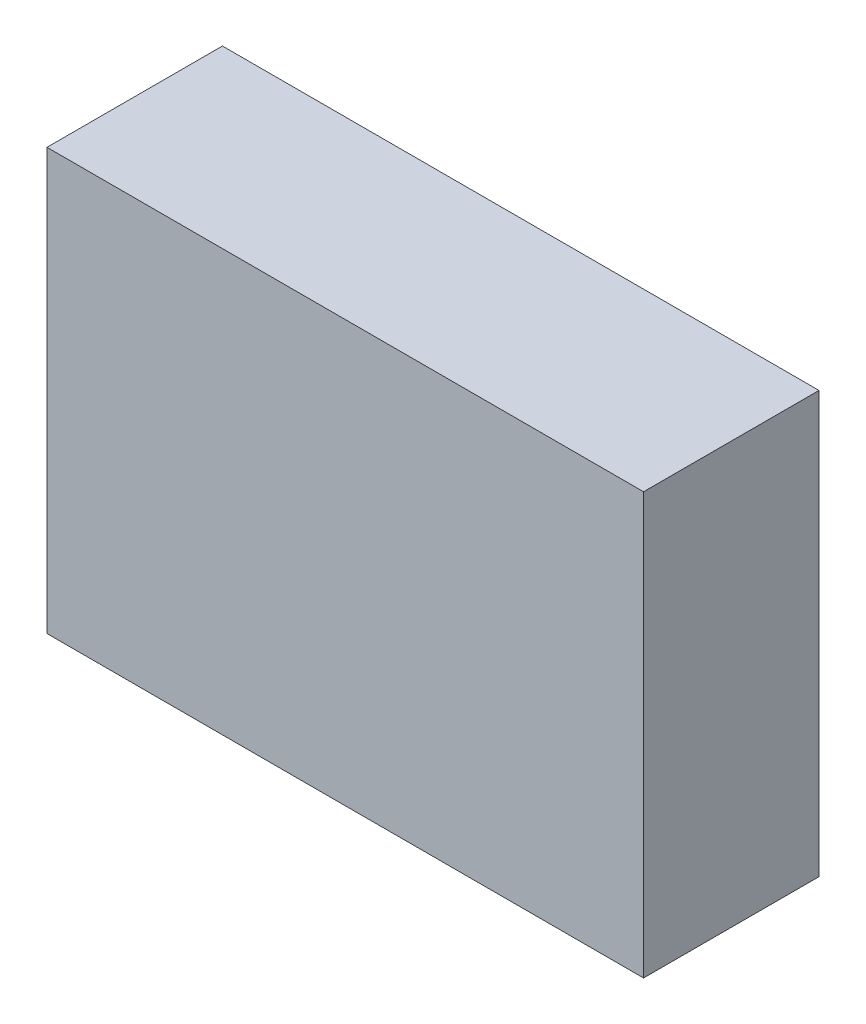
ISO-10303-21;
HEADER;
FILE_DESCRIPTION(('STEP AP214'),'2;1');
FILE_NAME('part.step','',(''),(''),'','','');
FILE_SCHEMA(('AUTOMOTIVE_DESIGN { 1 0 10303 214 1 1 1 1 }'));
ENDSEC;
DATA;
#1=APPLICATION_CONTEXT('core data for automotive mechanical design processes');
#2=APPLICATION_PROTOCOL_DEFINITION('international standard','automotive_design',2000,#1);
#3=PRODUCT_CONTEXT('',#1,'mechanical');
#4=PRODUCT('Part','Part','',(#3));
#5=PRODUCT_RELATED_PRODUCT_CATEGORY('part','',(#4));
#6=PRODUCT_DEFINITION_FORMATION('','',#4);
#7=PRODUCT_DEFINITION_CONTEXT('part definition',#1,'design');
#8=PRODUCT_DEFINITION('design','',#6,#7);
#9=PRODUCT_DEFINITION_SHAPE('','',#8);
#10=(LENGTH_UNIT() NAMED_UNIT(*) SI_UNIT(.MILLI.,.METRE.));
#11=(NAMED_UNIT(*) PLANE_ANGLE_UNIT() SI_UNIT($,.RADIAN.));
#12=(NAMED_UNIT(*) SI_UNIT($,.STERADIAN.) SOLID_ANGLE_UNIT());
#13=UNCERTAINTY_MEASURE_WITH_UNIT(LENGTH_MEASURE(1.E-05),#10,'distance_accuracy_value','');
#14=(GEOMETRIC_REPRESENTATION_CONTEXT(3) GLOBAL_UNCERTAINTY_ASSIGNED_CONTEXT((#13)) GLOBAL_UNIT_ASSIGNED_CONTEXT((#10,
#11,#12)) REPRESENTATION_CONTEXT('',''));
#15=CARTESIAN_POINT('',(0.,0.,0.));
#16=DIRECTION('',(0.,0.,1.));
#17=DIRECTION('',(1.,0.,0.));
#18=AXIS2_PLACEMENT_3D('',#15,#16,#17);
#19=CARTESIAN_POINT('',(-2.92,1.63,0.));
#20=DIRECTION('',(1.,0.,0.));
#21=DIRECTION('',(0.,0.,1.));
#22=AXIS2_PLACEMENT_3D('',#19,#20,#21);
#23=PLANE('',#22);
#24=DIRECTION('',(0.,1.,0.));
#25=VECTOR('',#24,1.);
#26=CARTESIAN_POINT('',(-2.92,1.63,0.1));
#27=LINE('',#26,#25);
#28=CARTESIAN_POINT('',(-2.92,1.63,0.1));
#29=VERTEX_POINT('',#28);
#30=CARTESIAN_POINT('',(-2.92,1.87,0.1));
#31=VERTEX_POINT('',#30);
#32=EDGE_CURVE('E11',#29,#31,#27,.T.);
#33=ORIENTED_EDGE('',*,*,#32,.T.);
#34=DIRECTION('',(0.,0.,1.));
#35=VECTOR('',#34,1.);
#36=CARTESIAN_POINT('',(-2.92,1.87,0.));
#37=LINE('',#36,#35);
#38=CARTESIAN_POINT('',(-2.92,1.87,0.));
#39=VERTEX_POINT('',#38);
#40=EDGE_CURVE('E24',#39,#31,#37,.T.);
#41=ORIENTED_EDGE('',*,*,#40,.F.);
#42=DIRECTION('',(0.,1.,0.));
#43=VECTOR('',#42,1.);
#44=CARTESIAN_POINT('',(-2.92,1.63,0.));
#45=LINE('',#44,#43);
#46=CARTESIAN_POINT('',(-2.92,1.63,0.));
#47=VERTEX_POINT('',#46);
#48=EDGE_CURVE('E86',#47,#39,#45,.T.);
#49=ORIENTED_EDGE('',*,*,#48,.F.);
#50=DIRECTION('',(0.,0.,1.));
#51=VECTOR('',#50,1.);
#52=CARTESIAN_POINT('',(-2.92,1.63,0.));
#53=LINE('',#52,#51);
#54=EDGE_CURVE('E36',#47,#29,#53,.T.);
#55=ORIENTED_EDGE('',*,*,#54,.T.);
#56=EDGE_LOOP('',(#33,#41,#49,#55));
#57=FACE_BOUND('',#56,.T.);
#58=ADVANCED_FACE('F17',(#57),#23,.F.);
#59=CARTESIAN_POINT('',(-2.58,1.63,0.));
#60=DIRECTION('',(1.,0.,0.));
#61=DIRECTION('',(0.,0.,1.));
#62=AXIS2_PLACEMENT_3D('',#59,#60,#61);
#63=PLANE('',#62);
#64=DIRECTION('',(0.,0.,1.));
#65=VECTOR('',#64,1.);
#66=CARTESIAN_POINT('',(-2.58,1.63,0.));
#67=LINE('',#66,#65);
#68=CARTESIAN_POINT('',(-2.58,1.63,0.));
#69=VERTEX_POINT('',#68);
#70=CARTESIAN_POINT('',(-2.58,1.63,0.1));
#71=VERTEX_POINT('',#70);
#72=EDGE_CURVE('E83',#69,#71,#67,.T.);
#73=ORIENTED_EDGE('',*,*,#72,.F.);
#74=DIRECTION('',(0.,1.,0.));
#75=VECTOR('',#74,1.);
#76=CARTESIAN_POINT('',(-2.58,1.63,0.));
#77=LINE('',#76,#75);
#78=CARTESIAN_POINT('',(-2.58,1.87,0.));
#79=VERTEX_POINT('',#78);
#80=EDGE_CURVE('E63',#69,#79,#77,.T.);
#81=ORIENTED_EDGE('',*,*,#80,.T.);
#82=DIRECTION('',(0.,0.,1.));
#83=VECTOR('',#82,1.);
#84=CARTESIAN_POINT('',(-2.58,1.87,0.));
#85=LINE('',#84,#83);
#86=CARTESIAN_POINT('',(-2.58,1.87,0.1));
#87=VERTEX_POINT('',#86);
#88=EDGE_CURVE('E57',#79,#87,#85,.T.);
#89=ORIENTED_EDGE('',*,*,#88,.T.);
#90=DIRECTION('',(0.,1.,0.));
#91=VECTOR('',#90,1.);
#92=CARTESIAN_POINT('',(-2.58,1.63,0.1));
#93=LINE('',#92,#91);
#94=EDGE_CURVE('E60',#71,#87,#93,.T.);
#95=ORIENTED_EDGE('',*,*,#94,.F.);
#96=EDGE_LOOP('',(#73,#81,#89,#95));
#97=FACE_BOUND('',#96,.T.);
#98=ADVANCED_FACE('F59',(#97),#63,.T.);
#99=CARTESIAN_POINT('',(-2.92,1.63,0.));
#100=DIRECTION('',(0.,1.,0.));
#101=DIRECTION('',(0.,0.,1.));
#102=AXIS2_PLACEMENT_3D('',#99,#100,#101);
#103=PLANE('',#102);
#104=ORIENTED_EDGE('',*,*,#72,.T.);
#105=DIRECTION('',(1.,0.,0.));
#106=VECTOR('',#105,1.);
#107=CARTESIAN_POINT('',(-2.92,1.63,0.1));
#108=LINE('',#107,#106);
#109=EDGE_CURVE('E71',#29,#71,#108,.T.);
#110=ORIENTED_EDGE('',*,*,#109,.F.);
#111=ORIENTED_EDGE('',*,*,#54,.F.);
#112=DIRECTION('',(1.,0.,0.));
#113=VECTOR('',#112,1.);
#114=CARTESIAN_POINT('',(-2.92,1.63,0.));
#115=LINE('',#114,#113);
#116=EDGE_CURVE('E76',#47,#69,#115,.T.);
#117=ORIENTED_EDGE('',*,*,#116,.T.);
#118=EDGE_LOOP('',(#104,#110,#111,#117));
#119=FACE_BOUND('',#118,.T.);
#120=ADVANCED_FACE('F91',(#119),#103,.F.);
#121=CARTESIAN_POINT('',(-2.92,1.87,0.));
#122=DIRECTION('',(0.,1.,0.));
#123=DIRECTION('',(0.,0.,1.));
#124=AXIS2_PLACEMENT_3D('',#121,#122,#123);
#125=PLANE('',#124);
#126=DIRECTION('',(1.,0.,0.));
#127=VECTOR('',#126,1.);
#128=CARTESIAN_POINT('',(-2.92,1.87,0.));
#129=LINE('',#128,#127);
#130=EDGE_CURVE('E74',#39,#79,#129,.T.);
#131=ORIENTED_EDGE('',*,*,#130,.F.);
#132=ORIENTED_EDGE('',*,*,#40,.T.);
#133=DIRECTION('',(1.,0.,0.));
#134=VECTOR('',#133,1.);
#135=CARTESIAN_POINT('',(-2.92,1.87,0.1));
#136=LINE('',#135,#134);
#137=EDGE_CURVE('E69',#31,#87,#136,.T.);
#138=ORIENTED_EDGE('',*,*,#137,.T.);
#139=ORIENTED_EDGE('',*,*,#88,.F.);
#140=EDGE_LOOP('',(#131,#132,#138,#139));
#141=FACE_BOUND('',#140,.T.);
#142=ADVANCED_FACE('F73',(#141),#125,.T.);
#143=CARTESIAN_POINT('',(-2.92,1.63,0.));
#144=DIRECTION('',(0.,0.,1.));
#145=DIRECTION('',(1.,0.,0.));
#146=AXIS2_PLACEMENT_3D('',#143,#144,#145);
#147=PLANE('',#146);
#148=ORIENTED_EDGE('',*,*,#130,.T.);
#149=ORIENTED_EDGE('',*,*,#80,.F.);
#150=ORIENTED_EDGE('',*,*,#116,.F.);
#151=ORIENTED_EDGE('',*,*,#48,.T.);
#152=EDGE_LOOP('',(#148,#149,#150,#151));
#153=FACE_BOUND('',#152,.T.);
#154=ADVANCED_FACE('F89',(#153),#147,.F.);
#155=CARTESIAN_POINT('',(-2.92,1.63,0.1));
#156=DIRECTION('',(0.,0.,1.));
#157=DIRECTION('',(1.,0.,0.));
#158=AXIS2_PLACEMENT_3D('',#155,#156,#157);
#159=PLANE('',#158);
#160=ORIENTED_EDGE('',*,*,#32,.F.);
#161=ORIENTED_EDGE('',*,*,#109,.T.);
#162=ORIENTED_EDGE('',*,*,#94,.T.);
#163=ORIENTED_EDGE('',*,*,#137,.F.);
#164=EDGE_LOOP('',(#160,#161,#162,#163));
#165=FACE_BOUND('',#164,.T.);
#166=ADVANCED_FACE('F68',(#165),#159,.T.);
#167=CLOSED_SHELL('',(#58,#98,#120,#142,#154,#166));
#168=MANIFOLD_SOLID_BREP('B1',#167);
#169=ADVANCED_BREP_SHAPE_REPRESENTATION('',(#18,#168),#14);
#170=SHAPE_DEFINITION_REPRESENTATION(#9,#169);
ENDSEC;
END-ISO-10303-21;
